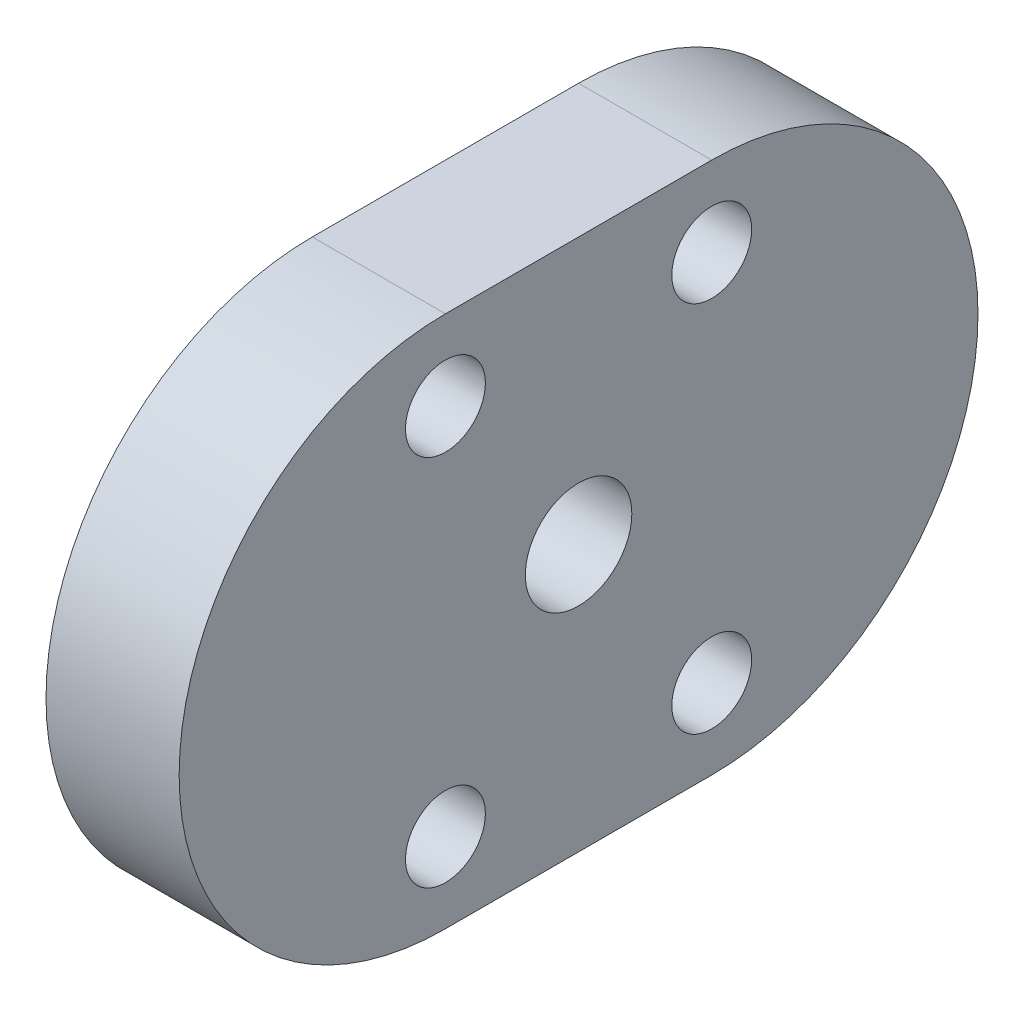
ISO-10303-21;
HEADER;
FILE_DESCRIPTION(('STEP AP214'),'2;1');
FILE_NAME('part.step','',(''),(''),'','','');
FILE_SCHEMA(('AUTOMOTIVE_DESIGN { 1 0 10303 214 1 1 1 1 }'));
ENDSEC;
DATA;
#1=APPLICATION_CONTEXT('core data for automotive mechanical design processes');
#2=APPLICATION_PROTOCOL_DEFINITION('international standard','automotive_design',2000,#1);
#3=PRODUCT_CONTEXT('',#1,'mechanical');
#4=PRODUCT('Part','Part','',(#3));
#5=PRODUCT_RELATED_PRODUCT_CATEGORY('part','',(#4));
#6=PRODUCT_DEFINITION_FORMATION('','',#4);
#7=PRODUCT_DEFINITION_CONTEXT('part definition',#1,'design');
#8=PRODUCT_DEFINITION('design','',#6,#7);
#9=PRODUCT_DEFINITION_SHAPE('','',#8);
#10=(LENGTH_UNIT() NAMED_UNIT(*) SI_UNIT(.MILLI.,.METRE.));
#11=(NAMED_UNIT(*) PLANE_ANGLE_UNIT() SI_UNIT($,.RADIAN.));
#12=(NAMED_UNIT(*) SI_UNIT($,.STERADIAN.) SOLID_ANGLE_UNIT());
#13=UNCERTAINTY_MEASURE_WITH_UNIT(LENGTH_MEASURE(1.E-05),#10,'distance_accuracy_value','');
#14=(GEOMETRIC_REPRESENTATION_CONTEXT(3) GLOBAL_UNCERTAINTY_ASSIGNED_CONTEXT((#13)) GLOBAL_UNIT_ASSIGNED_CONTEXT((#10,
#11,#12)) REPRESENTATION_CONTEXT('',''));
#15=CARTESIAN_POINT('',(0.,0.,0.));
#16=DIRECTION('',(0.,0.,1.));
#17=DIRECTION('',(1.,0.,0.));
#18=AXIS2_PLACEMENT_3D('',#15,#16,#17);
#19=CARTESIAN_POINT('',(5.,0.,5.));
#20=DIRECTION('',(-1.,0.,0.));
#21=DIRECTION('',(0.,0.,1.));
#22=AXIS2_PLACEMENT_3D('',#19,#20,#21);
#23=CYLINDRICAL_SURFACE('',#22,10.);
#24=CARTESIAN_POINT('',(0.,0.,5.));
#25=DIRECTION('',(1.,0.,0.));
#26=DIRECTION('',(0.,0.,-1.));
#27=AXIS2_PLACEMENT_3D('',#24,#25,#26);
#28=CIRCLE('',#27,10.);
#29=CARTESIAN_POINT('',(0.,10.,5.));
#30=VERTEX_POINT('',#29);
#31=CARTESIAN_POINT('',(0.,-10.,5.));
#32=VERTEX_POINT('',#31);
#33=EDGE_CURVE('E99',#30,#32,#28,.T.);
#34=ORIENTED_EDGE('',*,*,#33,.T.);
#35=DIRECTION('',(-1.,0.,0.));
#36=VECTOR('',#35,1.);
#37=CARTESIAN_POINT('',(5.,-10.,5.));
#38=LINE('',#37,#36);
#39=CARTESIAN_POINT('',(5.,-10.,5.));
#40=VERTEX_POINT('',#39);
#41=EDGE_CURVE('E11',#40,#32,#38,.T.);
#42=ORIENTED_EDGE('',*,*,#41,.F.);
#43=CARTESIAN_POINT('',(5.,0.,5.));
#44=DIRECTION('',(1.,0.,0.));
#45=DIRECTION('',(0.,0.,-1.));
#46=AXIS2_PLACEMENT_3D('',#43,#44,#45);
#47=CIRCLE('',#46,10.);
#48=CARTESIAN_POINT('',(5.,10.,5.));
#49=VERTEX_POINT('',#48);
#50=EDGE_CURVE('E87',#49,#40,#47,.T.);
#51=ORIENTED_EDGE('',*,*,#50,.F.);
#52=DIRECTION('',(-1.,0.,0.));
#53=VECTOR('',#52,1.);
#54=CARTESIAN_POINT('',(5.,10.,5.));
#55=LINE('',#54,#53);
#56=EDGE_CURVE('E95',#49,#30,#55,.T.);
#57=ORIENTED_EDGE('',*,*,#56,.T.);
#58=EDGE_LOOP('',(#34,#42,#51,#57));
#59=FACE_BOUND('',#58,.T.);
#60=ADVANCED_FACE('F36',(#59),#23,.T.);
#61=CARTESIAN_POINT('',(5.,-10.,5.));
#62=DIRECTION('',(0.,1.,0.));
#63=DIRECTION('',(0.,0.,1.));
#64=AXIS2_PLACEMENT_3D('',#61,#62,#63);
#65=PLANE('',#64);
#66=DIRECTION('',(0.,0.,-1.));
#67=VECTOR('',#66,1.);
#68=CARTESIAN_POINT('',(0.,-10.,5.));
#69=LINE('',#68,#67);
#70=CARTESIAN_POINT('',(0.,-10.,-5.));
#71=VERTEX_POINT('',#70);
#72=EDGE_CURVE('E91',#32,#71,#69,.T.);
#73=ORIENTED_EDGE('',*,*,#72,.T.);
#74=DIRECTION('',(-1.,0.,0.));
#75=VECTOR('',#74,1.);
#76=CARTESIAN_POINT('',(5.,-10.,-5.));
#77=LINE('',#76,#75);
#78=CARTESIAN_POINT('',(5.,-10.,-5.));
#79=VERTEX_POINT('',#78);
#80=EDGE_CURVE('E44',#79,#71,#77,.T.);
#81=ORIENTED_EDGE('',*,*,#80,.F.);
#82=DIRECTION('',(0.,0.,-1.));
#83=VECTOR('',#82,1.);
#84=CARTESIAN_POINT('',(5.,-10.,5.));
#85=LINE('',#84,#83);
#86=EDGE_CURVE('E82',#40,#79,#85,.T.);
#87=ORIENTED_EDGE('',*,*,#86,.F.);
#88=ORIENTED_EDGE('',*,*,#41,.T.);
#89=EDGE_LOOP('',(#73,#81,#87,#88));
#90=FACE_BOUND('',#89,.T.);
#91=ADVANCED_FACE('F90',(#90),#65,.F.);
#92=CARTESIAN_POINT('',(5.,0.,-5.));
#93=DIRECTION('',(-1.,0.,0.));
#94=DIRECTION('',(0.,0.,1.));
#95=AXIS2_PLACEMENT_3D('',#92,#93,#94);
#96=CYLINDRICAL_SURFACE('',#95,10.);
#97=CARTESIAN_POINT('',(0.,0.,-5.));
#98=DIRECTION('',(1.,0.,0.));
#99=DIRECTION('',(0.,0.,1.));
#100=AXIS2_PLACEMENT_3D('',#97,#98,#99);
#101=CIRCLE('',#100,10.);
#102=CARTESIAN_POINT('',(0.,10.,-5.));
#103=VERTEX_POINT('',#102);
#104=EDGE_CURVE('E69',#71,#103,#101,.T.);
#105=ORIENTED_EDGE('',*,*,#104,.T.);
#106=DIRECTION('',(-1.,0.,0.));
#107=VECTOR('',#106,1.);
#108=CARTESIAN_POINT('',(5.,10.,-5.));
#109=LINE('',#108,#107);
#110=CARTESIAN_POINT('',(5.,10.,-5.));
#111=VERTEX_POINT('',#110);
#112=EDGE_CURVE('E92',#111,#103,#109,.T.);
#113=ORIENTED_EDGE('',*,*,#112,.F.);
#114=CARTESIAN_POINT('',(5.,0.,-5.));
#115=DIRECTION('',(1.,0.,0.));
#116=DIRECTION('',(0.,0.,1.));
#117=AXIS2_PLACEMENT_3D('',#114,#115,#116);
#118=CIRCLE('',#117,10.);
#119=EDGE_CURVE('E85',#79,#111,#118,.T.);
#120=ORIENTED_EDGE('',*,*,#119,.F.);
#121=ORIENTED_EDGE('',*,*,#80,.T.);
#122=EDGE_LOOP('',(#105,#113,#120,#121));
#123=FACE_BOUND('',#122,.T.);
#124=ADVANCED_FACE('F93',(#123),#96,.T.);
#125=CARTESIAN_POINT('',(5.,10.,5.));
#126=DIRECTION('',(0.,-1.,0.));
#127=DIRECTION('',(0.,0.,-1.));
#128=AXIS2_PLACEMENT_3D('',#125,#126,#127);
#129=PLANE('',#128);
#130=DIRECTION('',(0.,0.,1.));
#131=VECTOR('',#130,1.);
#132=CARTESIAN_POINT('',(0.,10.,5.));
#133=LINE('',#132,#131);
#134=EDGE_CURVE('E75',#103,#30,#133,.T.);
#135=ORIENTED_EDGE('',*,*,#134,.T.);
#136=ORIENTED_EDGE('',*,*,#56,.F.);
#137=DIRECTION('',(0.,0.,1.));
#138=VECTOR('',#137,1.);
#139=CARTESIAN_POINT('',(5.,10.,5.));
#140=LINE('',#139,#138);
#141=EDGE_CURVE('E52',#111,#49,#140,.T.);
#142=ORIENTED_EDGE('',*,*,#141,.F.);
#143=ORIENTED_EDGE('',*,*,#112,.T.);
#144=EDGE_LOOP('',(#135,#136,#142,#143));
#145=FACE_BOUND('',#144,.T.);
#146=ADVANCED_FACE('F107',(#145),#129,.F.);
#147=CARTESIAN_POINT('',(5.,0.,5.));
#148=DIRECTION('',(1.,0.,0.));
#149=DIRECTION('',(0.,0.,-1.));
#150=AXIS2_PLACEMENT_3D('',#147,#148,#149);
#151=PLANE('',#150);
#152=CARTESIAN_POINT('',(5.,-7.,-5.));
#153=DIRECTION('',(1.,0.,0.));
#154=DIRECTION('',(0.,0.,-1.));
#155=AXIS2_PLACEMENT_3D('',#152,#153,#154);
#156=CIRCLE('',#155,1.5);
#157=CARTESIAN_POINT('',(5.,-7.,-6.5));
#158=VERTEX_POINT('',#157);
#159=EDGE_CURVE('E134',#158,#158,#156,.T.);
#160=ORIENTED_EDGE('',*,*,#159,.F.);
#161=EDGE_LOOP('',(#160));
#162=FACE_BOUND('',#161,.T.);
#163=CARTESIAN_POINT('',(5.,-7.,5.));
#164=DIRECTION('',(1.,0.,0.));
#165=DIRECTION('',(0.,0.,-1.));
#166=AXIS2_PLACEMENT_3D('',#163,#164,#165);
#167=CIRCLE('',#166,1.5);
#168=CARTESIAN_POINT('',(5.,-7.,3.5));
#169=VERTEX_POINT('',#168);
#170=EDGE_CURVE('E128',#169,#169,#167,.T.);
#171=ORIENTED_EDGE('',*,*,#170,.F.);
#172=EDGE_LOOP('',(#171));
#173=FACE_BOUND('',#172,.T.);
#174=CARTESIAN_POINT('',(5.,7.,-5.));
#175=DIRECTION('',(1.,0.,0.));
#176=DIRECTION('',(0.,0.,-1.));
#177=AXIS2_PLACEMENT_3D('',#174,#175,#176);
#178=CIRCLE('',#177,1.5);
#179=CARTESIAN_POINT('',(5.,7.,-6.5));
#180=VERTEX_POINT('',#179);
#181=EDGE_CURVE('E122',#180,#180,#178,.T.);
#182=ORIENTED_EDGE('',*,*,#181,.F.);
#183=EDGE_LOOP('',(#182));
#184=FACE_BOUND('',#183,.T.);
#185=CARTESIAN_POINT('',(5.,0.,0.));
#186=DIRECTION('',(1.,0.,0.));
#187=DIRECTION('',(0.,0.,-1.));
#188=AXIS2_PLACEMENT_3D('',#185,#186,#187);
#189=CIRCLE('',#188,2.);
#190=CARTESIAN_POINT('',(5.,0.,-2.));
#191=VERTEX_POINT('',#190);
#192=EDGE_CURVE('E116',#191,#191,#189,.T.);
#193=ORIENTED_EDGE('',*,*,#192,.F.);
#194=EDGE_LOOP('',(#193));
#195=FACE_BOUND('',#194,.T.);
#196=CARTESIAN_POINT('',(5.,7.,5.));
#197=DIRECTION('',(1.,0.,0.));
#198=DIRECTION('',(0.,0.,-1.));
#199=AXIS2_PLACEMENT_3D('',#196,#197,#198);
#200=CIRCLE('',#199,1.5);
#201=CARTESIAN_POINT('',(5.,7.,3.5));
#202=VERTEX_POINT('',#201);
#203=EDGE_CURVE('E102',#202,#202,#200,.T.);
#204=ORIENTED_EDGE('',*,*,#203,.F.);
#205=EDGE_LOOP('',(#204));
#206=FACE_BOUND('',#205,.T.);
#207=ORIENTED_EDGE('',*,*,#50,.T.);
#208=ORIENTED_EDGE('',*,*,#86,.T.);
#209=ORIENTED_EDGE('',*,*,#119,.T.);
#210=ORIENTED_EDGE('',*,*,#141,.T.);
#211=EDGE_LOOP('',(#207,#208,#209,#210));
#212=FACE_BOUND('',#211,.T.);
#213=ADVANCED_FACE('F83',(#162,#173,#184,#195,#206,#212),#151,.T.);
#214=CARTESIAN_POINT('',(0.,0.,5.));
#215=DIRECTION('',(1.,0.,0.));
#216=DIRECTION('',(0.,0.,-1.));
#217=AXIS2_PLACEMENT_3D('',#214,#215,#216);
#218=PLANE('',#217);
#219=CARTESIAN_POINT('',(0.,-7.,-5.));
#220=DIRECTION('',(1.,0.,0.));
#221=DIRECTION('',(0.,0.,-1.));
#222=AXIS2_PLACEMENT_3D('',#219,#220,#221);
#223=CIRCLE('',#222,1.5);
#224=CARTESIAN_POINT('',(0.,-7.,-6.5));
#225=VERTEX_POINT('',#224);
#226=EDGE_CURVE('E137',#225,#225,#223,.T.);
#227=ORIENTED_EDGE('',*,*,#226,.T.);
#228=EDGE_LOOP('',(#227));
#229=FACE_BOUND('',#228,.T.);
#230=CARTESIAN_POINT('',(0.,-7.,5.));
#231=DIRECTION('',(1.,0.,0.));
#232=DIRECTION('',(0.,0.,-1.));
#233=AXIS2_PLACEMENT_3D('',#230,#231,#232);
#234=CIRCLE('',#233,1.5);
#235=CARTESIAN_POINT('',(0.,-7.,3.5));
#236=VERTEX_POINT('',#235);
#237=EDGE_CURVE('E131',#236,#236,#234,.T.);
#238=ORIENTED_EDGE('',*,*,#237,.T.);
#239=EDGE_LOOP('',(#238));
#240=FACE_BOUND('',#239,.T.);
#241=CARTESIAN_POINT('',(0.,7.,-5.));
#242=DIRECTION('',(1.,0.,0.));
#243=DIRECTION('',(0.,0.,-1.));
#244=AXIS2_PLACEMENT_3D('',#241,#242,#243);
#245=CIRCLE('',#244,1.5);
#246=CARTESIAN_POINT('',(0.,7.,-6.5));
#247=VERTEX_POINT('',#246);
#248=EDGE_CURVE('E125',#247,#247,#245,.T.);
#249=ORIENTED_EDGE('',*,*,#248,.T.);
#250=EDGE_LOOP('',(#249));
#251=FACE_BOUND('',#250,.T.);
#252=CARTESIAN_POINT('',(0.,0.,0.));
#253=DIRECTION('',(1.,0.,0.));
#254=DIRECTION('',(0.,0.,-1.));
#255=AXIS2_PLACEMENT_3D('',#252,#253,#254);
#256=CIRCLE('',#255,2.);
#257=CARTESIAN_POINT('',(0.,0.,-2.));
#258=VERTEX_POINT('',#257);
#259=EDGE_CURVE('E119',#258,#258,#256,.T.);
#260=ORIENTED_EDGE('',*,*,#259,.T.);
#261=EDGE_LOOP('',(#260));
#262=FACE_BOUND('',#261,.T.);
#263=CARTESIAN_POINT('',(0.,7.,5.));
#264=DIRECTION('',(1.,0.,0.));
#265=DIRECTION('',(0.,0.,-1.));
#266=AXIS2_PLACEMENT_3D('',#263,#264,#265);
#267=CIRCLE('',#266,1.5);
#268=CARTESIAN_POINT('',(0.,7.,3.5));
#269=VERTEX_POINT('',#268);
#270=EDGE_CURVE('E113',#269,#269,#267,.T.);
#271=ORIENTED_EDGE('',*,*,#270,.T.);
#272=EDGE_LOOP('',(#271));
#273=FACE_BOUND('',#272,.T.);
#274=ORIENTED_EDGE('',*,*,#33,.F.);
#275=ORIENTED_EDGE('',*,*,#134,.F.);
#276=ORIENTED_EDGE('',*,*,#104,.F.);
#277=ORIENTED_EDGE('',*,*,#72,.F.);
#278=EDGE_LOOP('',(#274,#275,#276,#277));
#279=FACE_BOUND('',#278,.T.);
#280=ADVANCED_FACE('F110',(#229,#240,#251,#262,#273,#279),#218,.F.);
#281=CARTESIAN_POINT('',(5.,7.,5.));
#282=DIRECTION('',(-1.,0.,0.));
#283=DIRECTION('',(0.,0.,1.));
#284=AXIS2_PLACEMENT_3D('',#281,#282,#283);
#285=CYLINDRICAL_SURFACE('',#284,1.5);
#286=ORIENTED_EDGE('',*,*,#203,.T.);
#287=EDGE_LOOP('',(#286));
#288=FACE_BOUND('',#287,.T.);
#289=ORIENTED_EDGE('',*,*,#270,.F.);
#290=EDGE_LOOP('',(#289));
#291=FACE_BOUND('',#290,.T.);
#292=ADVANCED_FACE('F157',(#288,#291),#285,.F.);
#293=CARTESIAN_POINT('',(5.,0.,0.));
#294=DIRECTION('',(-1.,0.,0.));
#295=DIRECTION('',(0.,0.,1.));
#296=AXIS2_PLACEMENT_3D('',#293,#294,#295);
#297=CYLINDRICAL_SURFACE('',#296,2.);
#298=ORIENTED_EDGE('',*,*,#192,.T.);
#299=EDGE_LOOP('',(#298));
#300=FACE_BOUND('',#299,.T.);
#301=ORIENTED_EDGE('',*,*,#259,.F.);
#302=EDGE_LOOP('',(#301));
#303=FACE_BOUND('',#302,.T.);
#304=ADVANCED_FACE('F160',(#300,#303),#297,.F.);
#305=CARTESIAN_POINT('',(5.,7.,-5.));
#306=DIRECTION('',(-1.,0.,0.));
#307=DIRECTION('',(0.,0.,1.));
#308=AXIS2_PLACEMENT_3D('',#305,#306,#307);
#309=CYLINDRICAL_SURFACE('',#308,1.5);
#310=ORIENTED_EDGE('',*,*,#181,.T.);
#311=EDGE_LOOP('',(#310));
#312=FACE_BOUND('',#311,.T.);
#313=ORIENTED_EDGE('',*,*,#248,.F.);
#314=EDGE_LOOP('',(#313));
#315=FACE_BOUND('',#314,.T.);
#316=ADVANCED_FACE('F208',(#312,#315),#309,.F.);
#317=CARTESIAN_POINT('',(5.,-7.,5.));
#318=DIRECTION('',(-1.,0.,0.));
#319=DIRECTION('',(0.,0.,1.));
#320=AXIS2_PLACEMENT_3D('',#317,#318,#319);
#321=CYLINDRICAL_SURFACE('',#320,1.5);
#322=ORIENTED_EDGE('',*,*,#170,.T.);
#323=EDGE_LOOP('',(#322));
#324=FACE_BOUND('',#323,.T.);
#325=ORIENTED_EDGE('',*,*,#237,.F.);
#326=EDGE_LOOP('',(#325));
#327=FACE_BOUND('',#326,.T.);
#328=ADVANCED_FACE('F218',(#324,#327),#321,.F.);
#329=CARTESIAN_POINT('',(5.,-7.,-5.));
#330=DIRECTION('',(-1.,0.,0.));
#331=DIRECTION('',(0.,0.,1.));
#332=AXIS2_PLACEMENT_3D('',#329,#330,#331);
#333=CYLINDRICAL_SURFACE('',#332,1.5);
#334=ORIENTED_EDGE('',*,*,#159,.T.);
#335=EDGE_LOOP('',(#334));
#336=FACE_BOUND('',#335,.T.);
#337=ORIENTED_EDGE('',*,*,#226,.F.);
#338=EDGE_LOOP('',(#337));
#339=FACE_BOUND('',#338,.T.);
#340=ADVANCED_FACE('F143',(#336,#339),#333,.F.);
#341=CLOSED_SHELL('',(#60,#91,#124,#146,#213,#280,#292,#304,#316,#328,#340));
#342=MANIFOLD_SOLID_BREP('B2',#341);
#343=ADVANCED_BREP_SHAPE_REPRESENTATION('',(#18,#342),#14);
#344=SHAPE_DEFINITION_REPRESENTATION(#9,#343);
ENDSEC;
END-ISO-10303-21;
